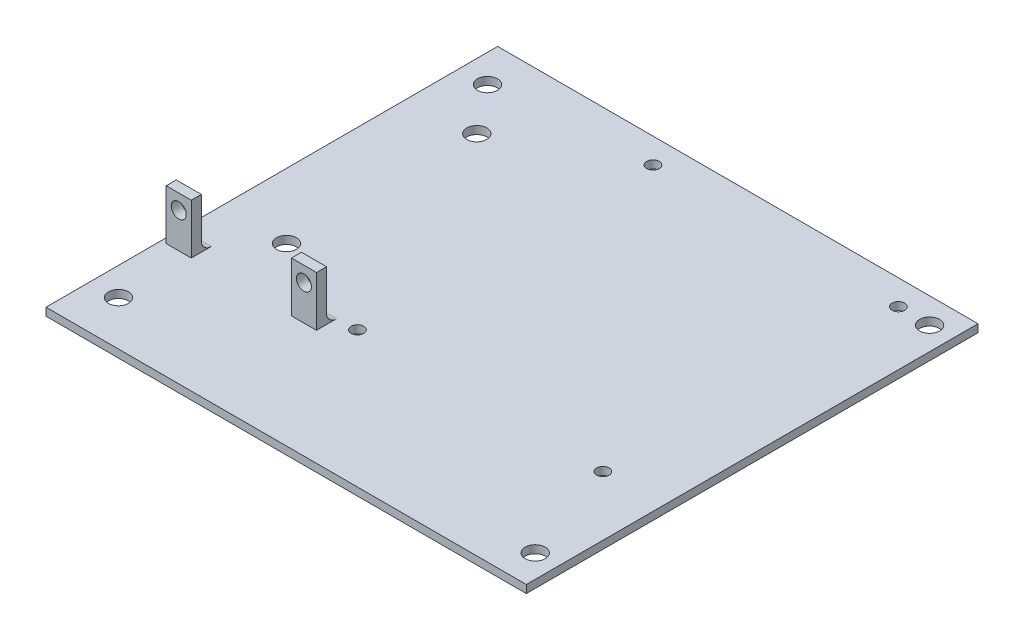
ISO-10303-21;
HEADER;
FILE_DESCRIPTION(('STEP AP214'),'2;1');
FILE_NAME('part.step','',(''),(''),'','','');
FILE_SCHEMA(('AUTOMOTIVE_DESIGN { 1 0 10303 214 1 1 1 1 }'));
ENDSEC;
DATA;
#1=APPLICATION_CONTEXT('core data for automotive mechanical design processes');
#2=APPLICATION_PROTOCOL_DEFINITION('international standard','automotive_design',2000,#1);
#3=PRODUCT_CONTEXT('',#1,'mechanical');
#4=PRODUCT('Part','Part','',(#3));
#5=PRODUCT_RELATED_PRODUCT_CATEGORY('part','',(#4));
#6=PRODUCT_DEFINITION_FORMATION('','',#4);
#7=PRODUCT_DEFINITION_CONTEXT('part definition',#1,'design');
#8=PRODUCT_DEFINITION('design','',#6,#7);
#9=PRODUCT_DEFINITION_SHAPE('','',#8);
#10=(LENGTH_UNIT() NAMED_UNIT(*) SI_UNIT(.MILLI.,.METRE.));
#11=(NAMED_UNIT(*) PLANE_ANGLE_UNIT() SI_UNIT($,.RADIAN.));
#12=(NAMED_UNIT(*) SI_UNIT($,.STERADIAN.) SOLID_ANGLE_UNIT());
#13=UNCERTAINTY_MEASURE_WITH_UNIT(LENGTH_MEASURE(1.E-05),#10,'distance_accuracy_value','');
#14=(GEOMETRIC_REPRESENTATION_CONTEXT(3) GLOBAL_UNCERTAINTY_ASSIGNED_CONTEXT((#13)) GLOBAL_UNIT_ASSIGNED_CONTEXT((#10,
#11,#12)) REPRESENTATION_CONTEXT('',''));
#15=CARTESIAN_POINT('',(0.,0.,0.));
#16=DIRECTION('',(0.,0.,1.));
#17=DIRECTION('',(1.,0.,0.));
#18=AXIS2_PLACEMENT_3D('',#15,#16,#17);
#19=CARTESIAN_POINT('',(0.,1.57,0.));
#20=DIRECTION('',(0.,1.,0.));
#21=DIRECTION('',(0.,0.,1.));
#22=AXIS2_PLACEMENT_3D('',#19,#20,#21);
#23=PLANE('',#22);
#24=DIRECTION('',(0.,0.,1.));
#25=VECTOR('',#24,1.);
#26=CARTESIAN_POINT('',(-30.7440500490529,1.57,-41.5489965335949));
#27=LINE('',#26,#25);
#28=CARTESIAN_POINT('',(-30.7440500490529,1.57,-45.5489965335949));
#29=VERTEX_POINT('',#28);
#30=CARTESIAN_POINT('',(-30.7440500490529,1.57,-41.5489965335949));
#31=VERTEX_POINT('',#30);
#32=EDGE_CURVE('E155',#29,#31,#27,.T.);
#33=ORIENTED_EDGE('',*,*,#32,.F.);
#34=DIRECTION('',(-1.,0.,0.));
#35=VECTOR('',#34,1.);
#36=CARTESIAN_POINT('',(0.,1.57,-45.5489965335949));
#37=LINE('',#36,#35);
#38=CARTESIAN_POINT('',(-25.7440500490529,1.57,-45.5489965335949));
#39=VERTEX_POINT('',#38);
#40=EDGE_CURVE('E284',#29,#39,#37,.F.);
#41=ORIENTED_EDGE('',*,*,#40,.T.);
#42=DIRECTION('',(0.,0.,-1.));
#43=VECTOR('',#42,1.);
#44=CARTESIAN_POINT('',(-25.7440500490529,1.57,-41.5489965335949));
#45=LINE('',#44,#43);
#46=CARTESIAN_POINT('',(-25.7440500490529,1.57,-41.5489965335949));
#47=VERTEX_POINT('',#46);
#48=EDGE_CURVE('E168',#47,#39,#45,.T.);
#49=ORIENTED_EDGE('',*,*,#48,.F.);
#50=DIRECTION('',(1.,0.,0.));
#51=VECTOR('',#50,1.);
#52=CARTESIAN_POINT('',(-30.7440500490529,1.57,-41.5489965335949));
#53=LINE('',#52,#51);
#54=EDGE_CURVE('E158',#31,#47,#53,.T.);
#55=ORIENTED_EDGE('',*,*,#54,.F.);
#56=EDGE_LOOP('',(#33,#41,#49,#55));
#57=FACE_BOUND('',#56,.T.);
#58=CARTESIAN_POINT('',(-18.7440500490529,1.57,-53.5489965335949));
#59=DIRECTION('',(0.,1.,0.));
#60=DIRECTION('',(0.,0.,1.));
#61=AXIS2_PLACEMENT_3D('',#58,#59,#60);
#62=CIRCLE('',#61,2.);
#63=CARTESIAN_POINT('',(-18.7440500490529,1.57,-51.5489965335949));
#64=VERTEX_POINT('',#63);
#65=EDGE_CURVE('E187',#64,#64,#62,.T.);
#66=ORIENTED_EDGE('',*,*,#65,.F.);
#67=EDGE_LOOP('',(#66));
#68=FACE_BOUND('',#67,.T.);
#69=CARTESIAN_POINT('',(-18.7440500490529,1.57,-91.5489965335949));
#70=DIRECTION('',(0.,1.,0.));
#71=DIRECTION('',(0.,0.,1.));
#72=AXIS2_PLACEMENT_3D('',#69,#70,#71);
#73=CIRCLE('',#72,2.);
#74=CARTESIAN_POINT('',(-18.7440500490529,1.57,-89.5489965335949));
#75=VERTEX_POINT('',#74);
#76=EDGE_CURVE('E191',#75,#75,#73,.T.);
#77=ORIENTED_EDGE('',*,*,#76,.F.);
#78=EDGE_LOOP('',(#77));
#79=FACE_BOUND('',#78,.T.);
#80=CARTESIAN_POINT('',(53.2559499509471,1.57,-103.718996533595));
#81=DIRECTION('',(0.,1.,0.));
#82=DIRECTION('',(0.,0.,1.));
#83=AXIS2_PLACEMENT_3D('',#80,#81,#82);
#84=CIRCLE('',#83,1.25);
#85=CARTESIAN_POINT('',(53.2559499509471,1.57,-102.468996533595));
#86=VERTEX_POINT('',#85);
#87=EDGE_CURVE('E195',#86,#86,#84,.T.);
#88=ORIENTED_EDGE('',*,*,#87,.F.);
#89=EDGE_LOOP('',(#88));
#90=FACE_BOUND('',#89,.T.);
#91=CARTESIAN_POINT('',(4.2559499509471,1.57,-103.718996533595));
#92=DIRECTION('',(0.,1.,0.));
#93=DIRECTION('',(0.,0.,1.));
#94=AXIS2_PLACEMENT_3D('',#91,#92,#93);
#95=CIRCLE('',#94,1.25);
#96=CARTESIAN_POINT('',(4.2559499509471,1.57,-102.468996533595));
#97=VERTEX_POINT('',#96);
#98=EDGE_CURVE('E199',#97,#97,#95,.T.);
#99=ORIENTED_EDGE('',*,*,#98,.F.);
#100=EDGE_LOOP('',(#99));
#101=FACE_BOUND('',#100,.T.);
#102=CARTESIAN_POINT('',(52.2559499509471,1.57,-45.718996533595));
#103=DIRECTION('',(0.,1.,0.));
#104=DIRECTION('',(0.,0.,1.));
#105=AXIS2_PLACEMENT_3D('',#102,#103,#104);
#106=CIRCLE('',#105,1.25);
#107=CARTESIAN_POINT('',(52.2559499509471,1.57,-44.468996533595));
#108=VERTEX_POINT('',#107);
#109=EDGE_CURVE('E203',#108,#108,#106,.T.);
#110=ORIENTED_EDGE('',*,*,#109,.F.);
#111=EDGE_LOOP('',(#110));
#112=FACE_BOUND('',#111,.T.);
#113=CARTESIAN_POINT('',(3.25594995094711,1.57,-45.7189965335949));
#114=DIRECTION('',(0.,1.,0.));
#115=DIRECTION('',(0.,0.,1.));
#116=AXIS2_PLACEMENT_3D('',#113,#114,#115);
#117=CIRCLE('',#116,1.25);
#118=CARTESIAN_POINT('',(3.25594995094711,1.57,-44.4689965335949));
#119=VERTEX_POINT('',#118);
#120=EDGE_CURVE('E207',#119,#119,#117,.T.);
#121=ORIENTED_EDGE('',*,*,#120,.F.);
#122=EDGE_LOOP('',(#121));
#123=FACE_BOUND('',#122,.T.);
#124=DIRECTION('',(0.,0.,1.));
#125=VECTOR('',#124,1.);
#126=CARTESIAN_POINT('',(64.1459499509471,1.57,-108.718996533595));
#127=LINE('',#126,#125);
#128=CARTESIAN_POINT('',(64.1459499509471,1.57,-108.718996533595));
#129=VERTEX_POINT('',#128);
#130=CARTESIAN_POINT('',(64.1459499509471,1.57,-18.5489965335949));
#131=VERTEX_POINT('',#130);
#132=EDGE_CURVE('E215',#129,#131,#127,.T.);
#133=ORIENTED_EDGE('',*,*,#132,.F.);
#134=DIRECTION('',(-1.,0.,0.));
#135=VECTOR('',#134,1.);
#136=CARTESIAN_POINT('',(-32.2440500490529,1.57,-108.718996533595));
#137=LINE('',#136,#135);
#138=CARTESIAN_POINT('',(-31.7440500490529,1.57,-108.718996533595));
#139=VERTEX_POINT('',#138);
#140=EDGE_CURVE('E260',#129,#139,#137,.T.);
#141=ORIENTED_EDGE('',*,*,#140,.T.);
#142=DIRECTION('',(0.,0.,-1.));
#143=VECTOR('',#142,1.);
#144=CARTESIAN_POINT('',(-31.7440500490529,1.57,-18.5489965335949));
#145=LINE('',#144,#143);
#146=CARTESIAN_POINT('',(-31.7440500490529,1.57,-18.5489965335949));
#147=VERTEX_POINT('',#146);
#148=EDGE_CURVE('E220',#147,#139,#145,.T.);
#149=ORIENTED_EDGE('',*,*,#148,.F.);
#150=DIRECTION('',(1.,0.,0.));
#151=VECTOR('',#150,1.);
#152=CARTESIAN_POINT('',(-32.2440500490529,1.57,-18.5489965335949));
#153=LINE('',#152,#151);
#154=EDGE_CURVE('E257',#147,#131,#153,.T.);
#155=ORIENTED_EDGE('',*,*,#154,.T.);
#156=EDGE_LOOP('',(#133,#141,#149,#155));
#157=FACE_BOUND('',#156,.T.);
#158=CARTESIAN_POINT('',(59.5659499509471,1.57,-103.638996533595));
#159=DIRECTION('',(0.,1.,0.));
#160=DIRECTION('',(0.,0.,1.));
#161=AXIS2_PLACEMENT_3D('',#158,#159,#160);
#162=CIRCLE('',#161,2.);
#163=CARTESIAN_POINT('',(59.5659499509471,1.57,-101.638996533595));
#164=VERTEX_POINT('',#163);
#165=EDGE_CURVE('E231',#164,#164,#162,.T.);
#166=ORIENTED_EDGE('',*,*,#165,.F.);
#167=EDGE_LOOP('',(#166));
#168=FACE_BOUND('',#167,.T.);
#169=CARTESIAN_POINT('',(-26.1640500490529,1.57,-101.098996533595));
#170=DIRECTION('',(0.,1.,0.));
#171=DIRECTION('',(0.,0.,1.));
#172=AXIS2_PLACEMENT_3D('',#169,#170,#171);
#173=CIRCLE('',#172,2.);
#174=CARTESIAN_POINT('',(-26.1640500490529,1.57,-99.0989965335949));
#175=VERTEX_POINT('',#174);
#176=EDGE_CURVE('E236',#175,#175,#173,.T.);
#177=ORIENTED_EDGE('',*,*,#176,.F.);
#178=EDGE_LOOP('',(#177));
#179=FACE_BOUND('',#178,.T.);
#180=CARTESIAN_POINT('',(-26.1640500490529,1.57,-27.4389965335949));
#181=DIRECTION('',(0.,1.,0.));
#182=DIRECTION('',(0.,0.,1.));
#183=AXIS2_PLACEMENT_3D('',#180,#181,#182);
#184=CIRCLE('',#183,2.);
#185=CARTESIAN_POINT('',(-26.1640500490529,1.57,-25.4389965335949));
#186=VERTEX_POINT('',#185);
#187=EDGE_CURVE('E242',#186,#186,#184,.T.);
#188=ORIENTED_EDGE('',*,*,#187,.F.);
#189=EDGE_LOOP('',(#188));
#190=FACE_BOUND('',#189,.T.);
#191=CARTESIAN_POINT('',(59.5659499509471,1.57,-24.8989965335949));
#192=DIRECTION('',(0.,1.,0.));
#193=DIRECTION('',(0.,0.,1.));
#194=AXIS2_PLACEMENT_3D('',#191,#192,#193);
#195=CIRCLE('',#194,2.);
#196=CARTESIAN_POINT('',(59.5659499509471,1.57,-22.8989965335949));
#197=VERTEX_POINT('',#196);
#198=EDGE_CURVE('E248',#197,#197,#195,.T.);
#199=ORIENTED_EDGE('',*,*,#198,.F.);
#200=EDGE_LOOP('',(#199));
#201=FACE_BOUND('',#200,.T.);
#202=DIRECTION('',(0.,0.,1.));
#203=VECTOR('',#202,1.);
#204=CARTESIAN_POINT('',(-5.74405004905289,1.57,-41.5489965335949));
#205=LINE('',#204,#203);
#206=CARTESIAN_POINT('',(-5.74405004905289,1.57,-45.5489965335949));
#207=VERTEX_POINT('',#206);
#208=CARTESIAN_POINT('',(-5.74405004905289,1.57,-41.5489965335949));
#209=VERTEX_POINT('',#208);
#210=EDGE_CURVE('E297',#207,#209,#205,.T.);
#211=ORIENTED_EDGE('',*,*,#210,.F.);
#212=DIRECTION('',(-1.,0.,0.));
#213=VECTOR('',#212,1.);
#214=CARTESIAN_POINT('',(0.,1.57,-45.5489965335949));
#215=LINE('',#214,#213);
#216=CARTESIAN_POINT('',(-0.744050049052894,1.57,-45.5489965335949));
#217=VERTEX_POINT('',#216);
#218=EDGE_CURVE('E281',#207,#217,#215,.F.);
#219=ORIENTED_EDGE('',*,*,#218,.T.);
#220=DIRECTION('',(0.,0.,-1.));
#221=VECTOR('',#220,1.);
#222=CARTESIAN_POINT('',(-0.744050049052894,1.57,-41.5489965335949));
#223=LINE('',#222,#221);
#224=CARTESIAN_POINT('',(-0.744050049052894,1.57,-41.5489965335949));
#225=VERTEX_POINT('',#224);
#226=EDGE_CURVE('E301',#225,#217,#223,.T.);
#227=ORIENTED_EDGE('',*,*,#226,.F.);
#228=DIRECTION('',(1.,0.,0.));
#229=VECTOR('',#228,1.);
#230=CARTESIAN_POINT('',(-0.744050049052894,1.57,-41.5489965335949));
#231=LINE('',#230,#229);
#232=EDGE_CURVE('E152',#209,#225,#231,.T.);
#233=ORIENTED_EDGE('',*,*,#232,.F.);
#234=EDGE_LOOP('',(#211,#219,#227,#233));
#235=FACE_BOUND('',#234,.T.);
#236=ADVANCED_FACE('F35',(#57,#68,#79,#90,#101,#112,#123,#157,#168,#179,#190,#201,#235),#23,.T.);
#237=CARTESIAN_POINT('',(-32.2440500490529,1.57,-18.5489965335949));
#238=DIRECTION('',(0.,0.,-1.));
#239=DIRECTION('',(-1.,0.,0.));
#240=AXIS2_PLACEMENT_3D('',#237,#238,#239);
#241=PLANE('',#240);
#242=DIRECTION('',(1.,0.,0.));
#243=VECTOR('',#242,1.);
#244=CARTESIAN_POINT('',(-32.2440500490529,0.,-18.5489965335949));
#245=LINE('',#244,#243);
#246=CARTESIAN_POINT('',(-31.7440500490529,0.,-18.5489965335949));
#247=VERTEX_POINT('',#246);
#248=CARTESIAN_POINT('',(64.1459499509471,0.,-18.5489965335949));
#249=VERTEX_POINT('',#248);
#250=EDGE_CURVE('E254',#247,#249,#245,.T.);
#251=ORIENTED_EDGE('',*,*,#250,.T.);
#252=DIRECTION('',(0.,1.,0.));
#253=VECTOR('',#252,1.);
#254=CARTESIAN_POINT('',(64.1459499509471,0.,-18.5489965335949));
#255=LINE('',#254,#253);
#256=EDGE_CURVE('E217',#249,#131,#255,.T.);
#257=ORIENTED_EDGE('',*,*,#256,.T.);
#258=ORIENTED_EDGE('',*,*,#154,.F.);
#259=DIRECTION('',(0.,1.,0.));
#260=VECTOR('',#259,1.);
#261=CARTESIAN_POINT('',(-31.7440500490529,0.,-18.5489965335949));
#262=LINE('',#261,#260);
#263=EDGE_CURVE('E225',#247,#147,#262,.T.);
#264=ORIENTED_EDGE('',*,*,#263,.F.);
#265=EDGE_LOOP('',(#251,#257,#258,#264));
#266=FACE_BOUND('',#265,.T.);
#267=ADVANCED_FACE('F338',(#266),#241,.F.);
#268=CARTESIAN_POINT('',(-32.2440500490529,1.57,-108.718996533595));
#269=DIRECTION('',(0.,0.,1.));
#270=DIRECTION('',(1.,0.,0.));
#271=AXIS2_PLACEMENT_3D('',#268,#269,#270);
#272=PLANE('',#271);
#273=ORIENTED_EDGE('',*,*,#140,.F.);
#274=DIRECTION('',(0.,1.,0.));
#275=VECTOR('',#274,1.);
#276=CARTESIAN_POINT('',(64.1459499509471,0.,-108.718996533595));
#277=LINE('',#276,#275);
#278=CARTESIAN_POINT('',(64.1459499509471,0.,-108.718996533595));
#279=VERTEX_POINT('',#278);
#280=EDGE_CURVE('E214',#279,#129,#277,.T.);
#281=ORIENTED_EDGE('',*,*,#280,.F.);
#282=DIRECTION('',(-1.,0.,0.));
#283=VECTOR('',#282,1.);
#284=CARTESIAN_POINT('',(-32.2440500490529,0.,-108.718996533595));
#285=LINE('',#284,#283);
#286=CARTESIAN_POINT('',(-31.7440500490529,0.,-108.718996533595));
#287=VERTEX_POINT('',#286);
#288=EDGE_CURVE('E261',#279,#287,#285,.T.);
#289=ORIENTED_EDGE('',*,*,#288,.T.);
#290=DIRECTION('',(0.,1.,0.));
#291=VECTOR('',#290,1.);
#292=CARTESIAN_POINT('',(-31.7440500490529,0.,-108.718996533595));
#293=LINE('',#292,#291);
#294=EDGE_CURVE('E228',#287,#139,#293,.T.);
#295=ORIENTED_EDGE('',*,*,#294,.T.);
#296=EDGE_LOOP('',(#273,#281,#289,#295));
#297=FACE_BOUND('',#296,.T.);
#298=ADVANCED_FACE('F344',(#297),#272,.F.);
#299=CARTESIAN_POINT('',(0.,0.,0.));
#300=DIRECTION('',(0.,1.,0.));
#301=DIRECTION('',(0.,0.,1.));
#302=AXIS2_PLACEMENT_3D('',#299,#300,#301);
#303=PLANE('',#302);
#304=CARTESIAN_POINT('',(-18.7440500490529,0.,-53.5489965335949));
#305=DIRECTION('',(0.,1.,0.));
#306=DIRECTION('',(0.,0.,1.));
#307=AXIS2_PLACEMENT_3D('',#304,#305,#306);
#308=CIRCLE('',#307,2.);
#309=CARTESIAN_POINT('',(-18.7440500490529,0.,-51.5489965335949));
#310=VERTEX_POINT('',#309);
#311=EDGE_CURVE('E190',#310,#310,#308,.T.);
#312=ORIENTED_EDGE('',*,*,#311,.T.);
#313=EDGE_LOOP('',(#312));
#314=FACE_BOUND('',#313,.T.);
#315=CARTESIAN_POINT('',(-18.7440500490529,0.,-91.5489965335949));
#316=DIRECTION('',(0.,1.,0.));
#317=DIRECTION('',(0.,0.,1.));
#318=AXIS2_PLACEMENT_3D('',#315,#316,#317);
#319=CIRCLE('',#318,2.);
#320=CARTESIAN_POINT('',(-18.7440500490529,0.,-89.5489965335949));
#321=VERTEX_POINT('',#320);
#322=EDGE_CURVE('E194',#321,#321,#319,.T.);
#323=ORIENTED_EDGE('',*,*,#322,.T.);
#324=EDGE_LOOP('',(#323));
#325=FACE_BOUND('',#324,.T.);
#326=CARTESIAN_POINT('',(53.2559499509471,0.,-103.718996533595));
#327=DIRECTION('',(0.,1.,0.));
#328=DIRECTION('',(0.,0.,1.));
#329=AXIS2_PLACEMENT_3D('',#326,#327,#328);
#330=CIRCLE('',#329,1.25);
#331=CARTESIAN_POINT('',(53.2559499509471,0.,-102.468996533595));
#332=VERTEX_POINT('',#331);
#333=EDGE_CURVE('E198',#332,#332,#330,.T.);
#334=ORIENTED_EDGE('',*,*,#333,.T.);
#335=EDGE_LOOP('',(#334));
#336=FACE_BOUND('',#335,.T.);
#337=CARTESIAN_POINT('',(4.2559499509471,0.,-103.718996533595));
#338=DIRECTION('',(0.,1.,0.));
#339=DIRECTION('',(0.,0.,1.));
#340=AXIS2_PLACEMENT_3D('',#337,#338,#339);
#341=CIRCLE('',#340,1.25);
#342=CARTESIAN_POINT('',(4.2559499509471,0.,-102.468996533595));
#343=VERTEX_POINT('',#342);
#344=EDGE_CURVE('E202',#343,#343,#341,.T.);
#345=ORIENTED_EDGE('',*,*,#344,.T.);
#346=EDGE_LOOP('',(#345));
#347=FACE_BOUND('',#346,.T.);
#348=CARTESIAN_POINT('',(52.2559499509471,0.,-45.718996533595));
#349=DIRECTION('',(0.,1.,0.));
#350=DIRECTION('',(0.,0.,1.));
#351=AXIS2_PLACEMENT_3D('',#348,#349,#350);
#352=CIRCLE('',#351,1.25);
#353=CARTESIAN_POINT('',(52.2559499509471,0.,-44.468996533595));
#354=VERTEX_POINT('',#353);
#355=EDGE_CURVE('E206',#354,#354,#352,.T.);
#356=ORIENTED_EDGE('',*,*,#355,.T.);
#357=EDGE_LOOP('',(#356));
#358=FACE_BOUND('',#357,.T.);
#359=CARTESIAN_POINT('',(3.25594995094711,0.,-45.7189965335949));
#360=DIRECTION('',(0.,1.,0.));
#361=DIRECTION('',(0.,0.,1.));
#362=AXIS2_PLACEMENT_3D('',#359,#360,#361);
#363=CIRCLE('',#362,1.25);
#364=CARTESIAN_POINT('',(3.25594995094711,0.,-44.4689965335949));
#365=VERTEX_POINT('',#364);
#366=EDGE_CURVE('E210',#365,#365,#363,.T.);
#367=ORIENTED_EDGE('',*,*,#366,.T.);
#368=EDGE_LOOP('',(#367));
#369=FACE_BOUND('',#368,.T.);
#370=CARTESIAN_POINT('',(59.5659499509471,0.,-103.638996533595));
#371=DIRECTION('',(0.,1.,0.));
#372=DIRECTION('',(0.,0.,1.));
#373=AXIS2_PLACEMENT_3D('',#370,#371,#372);
#374=CIRCLE('',#373,2.);
#375=CARTESIAN_POINT('',(59.5659499509471,0.,-101.638996533595));
#376=VERTEX_POINT('',#375);
#377=EDGE_CURVE('E233',#376,#376,#374,.T.);
#378=ORIENTED_EDGE('',*,*,#377,.T.);
#379=EDGE_LOOP('',(#378));
#380=FACE_BOUND('',#379,.T.);
#381=CARTESIAN_POINT('',(-26.1640500490529,0.,-101.098996533595));
#382=DIRECTION('',(0.,1.,0.));
#383=DIRECTION('',(0.,0.,1.));
#384=AXIS2_PLACEMENT_3D('',#381,#382,#383);
#385=CIRCLE('',#384,2.);
#386=CARTESIAN_POINT('',(-26.1640500490529,0.,-99.0989965335949));
#387=VERTEX_POINT('',#386);
#388=EDGE_CURVE('E239',#387,#387,#385,.T.);
#389=ORIENTED_EDGE('',*,*,#388,.T.);
#390=EDGE_LOOP('',(#389));
#391=FACE_BOUND('',#390,.T.);
#392=CARTESIAN_POINT('',(-26.1640500490529,0.,-27.4389965335949));
#393=DIRECTION('',(0.,1.,0.));
#394=DIRECTION('',(0.,0.,1.));
#395=AXIS2_PLACEMENT_3D('',#392,#393,#394);
#396=CIRCLE('',#395,2.);
#397=CARTESIAN_POINT('',(-26.1640500490529,0.,-25.4389965335949));
#398=VERTEX_POINT('',#397);
#399=EDGE_CURVE('E245',#398,#398,#396,.T.);
#400=ORIENTED_EDGE('',*,*,#399,.T.);
#401=EDGE_LOOP('',(#400));
#402=FACE_BOUND('',#401,.T.);
#403=CARTESIAN_POINT('',(59.5659499509471,0.,-24.8989965335949));
#404=DIRECTION('',(0.,1.,0.));
#405=DIRECTION('',(0.,0.,1.));
#406=AXIS2_PLACEMENT_3D('',#403,#404,#405);
#407=CIRCLE('',#406,2.);
#408=CARTESIAN_POINT('',(59.5659499509471,0.,-22.8989965335949));
#409=VERTEX_POINT('',#408);
#410=EDGE_CURVE('E251',#409,#409,#407,.T.);
#411=ORIENTED_EDGE('',*,*,#410,.T.);
#412=EDGE_LOOP('',(#411));
#413=FACE_BOUND('',#412,.T.);
#414=ORIENTED_EDGE('',*,*,#288,.F.);
#415=DIRECTION('',(0.,0.,1.));
#416=VECTOR('',#415,1.);
#417=CARTESIAN_POINT('',(64.1459499509471,0.,-108.718996533595));
#418=LINE('',#417,#416);
#419=EDGE_CURVE('E211',#279,#249,#418,.T.);
#420=ORIENTED_EDGE('',*,*,#419,.T.);
#421=ORIENTED_EDGE('',*,*,#250,.F.);
#422=DIRECTION('',(0.,0.,-1.));
#423=VECTOR('',#422,1.);
#424=CARTESIAN_POINT('',(-31.7440500490529,0.,-18.5489965335949));
#425=LINE('',#424,#423);
#426=EDGE_CURVE('E222',#247,#287,#425,.T.);
#427=ORIENTED_EDGE('',*,*,#426,.T.);
#428=EDGE_LOOP('',(#414,#420,#421,#427));
#429=FACE_BOUND('',#428,.T.);
#430=ADVANCED_FACE('F352',(#314,#325,#336,#347,#358,#369,#380,#391,#402,#413,#429),#303,.F.);
#431=CARTESIAN_POINT('',(59.5659499509471,0.,-24.8989965335949));
#432=DIRECTION('',(0.,1.,0.));
#433=DIRECTION('',(0.,0.,1.));
#434=AXIS2_PLACEMENT_3D('',#431,#432,#433);
#435=CYLINDRICAL_SURFACE('',#434,2.);
#436=ORIENTED_EDGE('',*,*,#410,.F.);
#437=EDGE_LOOP('',(#436));
#438=FACE_BOUND('',#437,.T.);
#439=ORIENTED_EDGE('',*,*,#198,.T.);
#440=EDGE_LOOP('',(#439));
#441=FACE_BOUND('',#440,.T.);
#442=ADVANCED_FACE('F350',(#438,#441),#435,.F.);
#443=CARTESIAN_POINT('',(-26.1640500490529,0.,-27.4389965335949));
#444=DIRECTION('',(0.,1.,0.));
#445=DIRECTION('',(0.,0.,1.));
#446=AXIS2_PLACEMENT_3D('',#443,#444,#445);
#447=CYLINDRICAL_SURFACE('',#446,2.);
#448=ORIENTED_EDGE('',*,*,#399,.F.);
#449=EDGE_LOOP('',(#448));
#450=FACE_BOUND('',#449,.T.);
#451=ORIENTED_EDGE('',*,*,#187,.T.);
#452=EDGE_LOOP('',(#451));
#453=FACE_BOUND('',#452,.T.);
#454=ADVANCED_FACE('F436',(#450,#453),#447,.F.);
#455=CARTESIAN_POINT('',(-26.1640500490529,0.,-101.098996533595));
#456=DIRECTION('',(0.,1.,0.));
#457=DIRECTION('',(0.,0.,1.));
#458=AXIS2_PLACEMENT_3D('',#455,#456,#457);
#459=CYLINDRICAL_SURFACE('',#458,2.);
#460=ORIENTED_EDGE('',*,*,#388,.F.);
#461=EDGE_LOOP('',(#460));
#462=FACE_BOUND('',#461,.T.);
#463=ORIENTED_EDGE('',*,*,#176,.T.);
#464=EDGE_LOOP('',(#463));
#465=FACE_BOUND('',#464,.T.);
#466=ADVANCED_FACE('F433',(#462,#465),#459,.F.);
#467=CARTESIAN_POINT('',(59.5659499509471,0.,-103.638996533595));
#468=DIRECTION('',(0.,1.,0.));
#469=DIRECTION('',(0.,0.,1.));
#470=AXIS2_PLACEMENT_3D('',#467,#468,#469);
#471=CYLINDRICAL_SURFACE('',#470,2.);
#472=ORIENTED_EDGE('',*,*,#377,.F.);
#473=EDGE_LOOP('',(#472));
#474=FACE_BOUND('',#473,.T.);
#475=ORIENTED_EDGE('',*,*,#165,.T.);
#476=EDGE_LOOP('',(#475));
#477=FACE_BOUND('',#476,.T.);
#478=ADVANCED_FACE('F429',(#474,#477),#471,.F.);
#479=CARTESIAN_POINT('',(-31.7440500490529,0.,-18.5489965335949));
#480=DIRECTION('',(1.,0.,0.));
#481=DIRECTION('',(0.,0.,-1.));
#482=AXIS2_PLACEMENT_3D('',#479,#480,#481);
#483=PLANE('',#482);
#484=ORIENTED_EDGE('',*,*,#148,.T.);
#485=ORIENTED_EDGE('',*,*,#294,.F.);
#486=ORIENTED_EDGE('',*,*,#426,.F.);
#487=ORIENTED_EDGE('',*,*,#263,.T.);
#488=EDGE_LOOP('',(#484,#485,#486,#487));
#489=FACE_BOUND('',#488,.T.);
#490=ADVANCED_FACE('F425',(#489),#483,.F.);
#491=CARTESIAN_POINT('',(64.1459499509471,0.,-108.718996533595));
#492=DIRECTION('',(-1.,0.,0.));
#493=DIRECTION('',(0.,0.,1.));
#494=AXIS2_PLACEMENT_3D('',#491,#492,#493);
#495=PLANE('',#494);
#496=ORIENTED_EDGE('',*,*,#132,.T.);
#497=ORIENTED_EDGE('',*,*,#256,.F.);
#498=ORIENTED_EDGE('',*,*,#419,.F.);
#499=ORIENTED_EDGE('',*,*,#280,.T.);
#500=EDGE_LOOP('',(#496,#497,#498,#499));
#501=FACE_BOUND('',#500,.T.);
#502=ADVANCED_FACE('F421',(#501),#495,.F.);
#503=CARTESIAN_POINT('',(3.25594995094711,-8.43,-45.7189965335949));
#504=DIRECTION('',(0.,1.,0.));
#505=DIRECTION('',(0.,0.,1.));
#506=AXIS2_PLACEMENT_3D('',#503,#504,#505);
#507=CYLINDRICAL_SURFACE('',#506,1.25);
#508=ORIENTED_EDGE('',*,*,#120,.T.);
#509=EDGE_LOOP('',(#508));
#510=FACE_BOUND('',#509,.T.);
#511=ORIENTED_EDGE('',*,*,#366,.F.);
#512=EDGE_LOOP('',(#511));
#513=FACE_BOUND('',#512,.T.);
#514=ADVANCED_FACE('F417',(#510,#513),#507,.F.);
#515=CARTESIAN_POINT('',(52.2559499509471,-8.43,-45.718996533595));
#516=DIRECTION('',(0.,1.,0.));
#517=DIRECTION('',(0.,0.,1.));
#518=AXIS2_PLACEMENT_3D('',#515,#516,#517);
#519=CYLINDRICAL_SURFACE('',#518,1.25);
#520=ORIENTED_EDGE('',*,*,#109,.T.);
#521=EDGE_LOOP('',(#520));
#522=FACE_BOUND('',#521,.T.);
#523=ORIENTED_EDGE('',*,*,#355,.F.);
#524=EDGE_LOOP('',(#523));
#525=FACE_BOUND('',#524,.T.);
#526=ADVANCED_FACE('F413',(#522,#525),#519,.F.);
#527=CARTESIAN_POINT('',(4.2559499509471,-8.43,-103.718996533595));
#528=DIRECTION('',(0.,1.,0.));
#529=DIRECTION('',(0.,0.,1.));
#530=AXIS2_PLACEMENT_3D('',#527,#528,#529);
#531=CYLINDRICAL_SURFACE('',#530,1.25);
#532=ORIENTED_EDGE('',*,*,#98,.T.);
#533=EDGE_LOOP('',(#532));
#534=FACE_BOUND('',#533,.T.);
#535=ORIENTED_EDGE('',*,*,#344,.F.);
#536=EDGE_LOOP('',(#535));
#537=FACE_BOUND('',#536,.T.);
#538=ADVANCED_FACE('F409',(#534,#537),#531,.F.);
#539=CARTESIAN_POINT('',(53.2559499509471,-8.43,-103.718996533595));
#540=DIRECTION('',(0.,1.,0.));
#541=DIRECTION('',(0.,0.,1.));
#542=AXIS2_PLACEMENT_3D('',#539,#540,#541);
#543=CYLINDRICAL_SURFACE('',#542,1.25);
#544=ORIENTED_EDGE('',*,*,#87,.T.);
#545=EDGE_LOOP('',(#544));
#546=FACE_BOUND('',#545,.T.);
#547=ORIENTED_EDGE('',*,*,#333,.F.);
#548=EDGE_LOOP('',(#547));
#549=FACE_BOUND('',#548,.T.);
#550=ADVANCED_FACE('F405',(#546,#549),#543,.F.);
#551=CARTESIAN_POINT('',(-18.7440500490529,-8.43,-91.5489965335949));
#552=DIRECTION('',(0.,1.,0.));
#553=DIRECTION('',(0.,0.,1.));
#554=AXIS2_PLACEMENT_3D('',#551,#552,#553);
#555=CYLINDRICAL_SURFACE('',#554,2.);
#556=ORIENTED_EDGE('',*,*,#76,.T.);
#557=EDGE_LOOP('',(#556));
#558=FACE_BOUND('',#557,.T.);
#559=ORIENTED_EDGE('',*,*,#322,.F.);
#560=EDGE_LOOP('',(#559));
#561=FACE_BOUND('',#560,.T.);
#562=ADVANCED_FACE('F401',(#558,#561),#555,.F.);
#563=CARTESIAN_POINT('',(-18.7440500490529,-8.43,-53.5489965335949));
#564=DIRECTION('',(0.,1.,0.));
#565=DIRECTION('',(0.,0.,1.));
#566=AXIS2_PLACEMENT_3D('',#563,#564,#565);
#567=CYLINDRICAL_SURFACE('',#566,2.);
#568=ORIENTED_EDGE('',*,*,#65,.T.);
#569=EDGE_LOOP('',(#568));
#570=FACE_BOUND('',#569,.T.);
#571=ORIENTED_EDGE('',*,*,#311,.F.);
#572=EDGE_LOOP('',(#571));
#573=FACE_BOUND('',#572,.T.);
#574=ADVANCED_FACE('F394',(#570,#573),#567,.F.);
#575=CARTESIAN_POINT('',(-30.7440500490529,11.57,-41.5489965335949));
#576=DIRECTION('',(1.,0.,0.));
#577=DIRECTION('',(0.,0.,-1.));
#578=AXIS2_PLACEMENT_3D('',#575,#576,#577);
#579=PLANE('',#578);
#580=ORIENTED_EDGE('',*,*,#32,.T.);
#581=DIRECTION('',(0.,-1.,0.));
#582=VECTOR('',#581,1.);
#583=CARTESIAN_POINT('',(-30.7440500490529,11.57,-41.5489965335949));
#584=LINE('',#583,#582);
#585=CARTESIAN_POINT('',(-30.7440500490529,11.57,-41.5489965335949));
#586=VERTEX_POINT('',#585);
#587=EDGE_CURVE('E185',#586,#31,#584,.T.);
#588=ORIENTED_EDGE('',*,*,#587,.F.);
#589=DIRECTION('',(0.,0.,1.));
#590=VECTOR('',#589,1.);
#591=CARTESIAN_POINT('',(-30.7440500490529,11.57,-41.5489965335949));
#592=LINE('',#591,#590);
#593=CARTESIAN_POINT('',(-30.7440500490529,11.57,-43.5489965335949));
#594=VERTEX_POINT('',#593);
#595=EDGE_CURVE('E164',#594,#586,#592,.T.);
#596=ORIENTED_EDGE('',*,*,#595,.F.);
#597=DIRECTION('',(0.,-1.,0.));
#598=VECTOR('',#597,1.);
#599=CARTESIAN_POINT('',(-30.7440500490529,11.57,-43.5489965335949));
#600=LINE('',#599,#598);
#601=CARTESIAN_POINT('',(-30.7440500490529,3.57,-43.5489965335949));
#602=VERTEX_POINT('',#601);
#603=EDGE_CURVE('E173',#594,#602,#600,.T.);
#604=ORIENTED_EDGE('',*,*,#603,.T.);
#605=CARTESIAN_POINT('',(-30.7440500490529,3.57,-45.5489965335949));
#606=DIRECTION('',(1.,0.,0.));
#607=DIRECTION('',(0.,0.,-1.));
#608=AXIS2_PLACEMENT_3D('',#605,#606,#607);
#609=CIRCLE('',#608,2.);
#610=EDGE_CURVE('E289',#602,#29,#609,.T.);
#611=ORIENTED_EDGE('',*,*,#610,.T.);
#612=EDGE_LOOP('',(#580,#588,#596,#604,#611));
#613=FACE_BOUND('',#612,.T.);
#614=ADVANCED_FACE('F384',(#613),#579,.F.);
#615=CARTESIAN_POINT('',(-30.7440500490529,11.57,-41.5489965335949));
#616=DIRECTION('',(0.,0.,-1.));
#617=DIRECTION('',(-1.,0.,0.));
#618=AXIS2_PLACEMENT_3D('',#615,#616,#617);
#619=PLANE('',#618);
#620=CARTESIAN_POINT('',(-28.2440500490529,8.57,-41.5489965335949));
#621=DIRECTION('',(0.,0.,1.));
#622=DIRECTION('',(1.,0.,0.));
#623=AXIS2_PLACEMENT_3D('',#620,#621,#622);
#624=CIRCLE('',#623,1.5);
#625=CARTESIAN_POINT('',(-26.7440500490529,8.57,-41.5489965335949));
#626=VERTEX_POINT('',#625);
#627=EDGE_CURVE('E315',#626,#626,#624,.T.);
#628=ORIENTED_EDGE('',*,*,#627,.F.);
#629=EDGE_LOOP('',(#628));
#630=FACE_BOUND('',#629,.T.);
#631=ORIENTED_EDGE('',*,*,#54,.T.);
#632=DIRECTION('',(0.,-1.,0.));
#633=VECTOR('',#632,1.);
#634=CARTESIAN_POINT('',(-25.7440500490529,11.57,-41.5489965335949));
#635=LINE('',#634,#633);
#636=CARTESIAN_POINT('',(-25.7440500490529,11.57,-41.5489965335949));
#637=VERTEX_POINT('',#636);
#638=EDGE_CURVE('E182',#637,#47,#635,.T.);
#639=ORIENTED_EDGE('',*,*,#638,.F.);
#640=DIRECTION('',(1.,0.,0.));
#641=VECTOR('',#640,1.);
#642=CARTESIAN_POINT('',(-30.7440500490529,11.57,-41.5489965335949));
#643=LINE('',#642,#641);
#644=EDGE_CURVE('E167',#586,#637,#643,.T.);
#645=ORIENTED_EDGE('',*,*,#644,.F.);
#646=ORIENTED_EDGE('',*,*,#587,.T.);
#647=EDGE_LOOP('',(#631,#639,#645,#646));
#648=FACE_BOUND('',#647,.T.);
#649=ADVANCED_FACE('F385',(#630,#648),#619,.F.);
#650=CARTESIAN_POINT('',(-25.7440500490529,11.57,-41.5489965335949));
#651=DIRECTION('',(-1.,0.,0.));
#652=DIRECTION('',(0.,0.,1.));
#653=AXIS2_PLACEMENT_3D('',#650,#651,#652);
#654=PLANE('',#653);
#655=ORIENTED_EDGE('',*,*,#48,.T.);
#656=CARTESIAN_POINT('',(-25.7440500490529,3.57,-45.5489965335949));
#657=DIRECTION('',(-1.,0.,0.));
#658=DIRECTION('',(0.,0.,1.));
#659=AXIS2_PLACEMENT_3D('',#656,#657,#658);
#660=CIRCLE('',#659,2.);
#661=CARTESIAN_POINT('',(-25.7440500490529,3.57,-43.5489965335949));
#662=VERTEX_POINT('',#661);
#663=EDGE_CURVE('E292',#39,#662,#660,.T.);
#664=ORIENTED_EDGE('',*,*,#663,.T.);
#665=DIRECTION('',(0.,-1.,0.));
#666=VECTOR('',#665,1.);
#667=CARTESIAN_POINT('',(-25.7440500490529,11.57,-43.5489965335949));
#668=LINE('',#667,#666);
#669=CARTESIAN_POINT('',(-25.7440500490529,11.57,-43.5489965335949));
#670=VERTEX_POINT('',#669);
#671=EDGE_CURVE('E179',#670,#662,#668,.T.);
#672=ORIENTED_EDGE('',*,*,#671,.F.);
#673=DIRECTION('',(0.,0.,-1.));
#674=VECTOR('',#673,1.);
#675=CARTESIAN_POINT('',(-25.7440500490529,11.57,-41.5489965335949));
#676=LINE('',#675,#674);
#677=EDGE_CURVE('E170',#637,#670,#676,.T.);
#678=ORIENTED_EDGE('',*,*,#677,.F.);
#679=ORIENTED_EDGE('',*,*,#638,.T.);
#680=EDGE_LOOP('',(#655,#664,#672,#678,#679));
#681=FACE_BOUND('',#680,.T.);
#682=ADVANCED_FACE('F369',(#681),#654,.F.);
#683=CARTESIAN_POINT('',(-30.7440500490529,11.57,-43.5489965335949));
#684=DIRECTION('',(0.,0.,1.));
#685=DIRECTION('',(1.,0.,0.));
#686=AXIS2_PLACEMENT_3D('',#683,#684,#685);
#687=PLANE('',#686);
#688=CARTESIAN_POINT('',(-28.2440500490529,8.57,-43.548996533595));
#689=DIRECTION('',(0.,0.,1.));
#690=DIRECTION('',(1.,0.,0.));
#691=AXIS2_PLACEMENT_3D('',#688,#689,#690);
#692=CIRCLE('',#691,1.5);
#693=CARTESIAN_POINT('',(-26.7440500490529,8.57,-43.548996533595));
#694=VERTEX_POINT('',#693);
#695=EDGE_CURVE('E304',#694,#694,#692,.F.);
#696=ORIENTED_EDGE('',*,*,#695,.F.);
#697=EDGE_LOOP('',(#696));
#698=FACE_BOUND('',#697,.T.);
#699=ORIENTED_EDGE('',*,*,#671,.T.);
#700=DIRECTION('',(-1.,0.,0.));
#701=VECTOR('',#700,1.);
#702=CARTESIAN_POINT('',(-30.7440500490529,3.57,-43.5489965335949));
#703=LINE('',#702,#701);
#704=EDGE_CURVE('E263',#662,#602,#703,.T.);
#705=ORIENTED_EDGE('',*,*,#704,.T.);
#706=ORIENTED_EDGE('',*,*,#603,.F.);
#707=DIRECTION('',(-1.,0.,0.));
#708=VECTOR('',#707,1.);
#709=CARTESIAN_POINT('',(-30.7440500490529,11.57,-43.5489965335949));
#710=LINE('',#709,#708);
#711=EDGE_CURVE('E172',#670,#594,#710,.T.);
#712=ORIENTED_EDGE('',*,*,#711,.F.);
#713=EDGE_LOOP('',(#699,#705,#706,#712));
#714=FACE_BOUND('',#713,.T.);
#715=ADVANCED_FACE('F374',(#698,#714),#687,.F.);
#716=CARTESIAN_POINT('',(0.,11.57,0.));
#717=DIRECTION('',(0.,-1.,0.));
#718=DIRECTION('',(0.,0.,-1.));
#719=AXIS2_PLACEMENT_3D('',#716,#717,#718);
#720=PLANE('',#719);
#721=ORIENTED_EDGE('',*,*,#595,.T.);
#722=ORIENTED_EDGE('',*,*,#644,.T.);
#723=ORIENTED_EDGE('',*,*,#677,.T.);
#724=ORIENTED_EDGE('',*,*,#711,.T.);
#725=EDGE_LOOP('',(#721,#722,#723,#724));
#726=FACE_BOUND('',#725,.T.);
#727=ADVANCED_FACE('F378',(#726),#720,.F.);
#728=CARTESIAN_POINT('',(-0.744050049052894,11.57,-41.5489965335949));
#729=DIRECTION('',(-1.,0.,0.));
#730=DIRECTION('',(0.,0.,1.));
#731=AXIS2_PLACEMENT_3D('',#728,#729,#730);
#732=PLANE('',#731);
#733=ORIENTED_EDGE('',*,*,#226,.T.);
#734=CARTESIAN_POINT('',(-0.744050049052894,3.57,-45.5489965335949));
#735=DIRECTION('',(-1.,0.,0.));
#736=DIRECTION('',(0.,0.,1.));
#737=AXIS2_PLACEMENT_3D('',#734,#735,#736);
#738=CIRCLE('',#737,2.);
#739=CARTESIAN_POINT('',(-0.744050049052894,3.57,-43.5489965335949));
#740=VERTEX_POINT('',#739);
#741=EDGE_CURVE('E11',#217,#740,#738,.T.);
#742=ORIENTED_EDGE('',*,*,#741,.T.);
#743=DIRECTION('',(0.,-1.,0.));
#744=VECTOR('',#743,1.);
#745=CARTESIAN_POINT('',(-0.744050049052894,11.57,-43.5489965335949));
#746=LINE('',#745,#744);
#747=CARTESIAN_POINT('',(-0.744050049052894,11.57,-43.5489965335949));
#748=VERTEX_POINT('',#747);
#749=EDGE_CURVE('E138',#748,#740,#746,.T.);
#750=ORIENTED_EDGE('',*,*,#749,.F.);
#751=DIRECTION('',(0.,0.,-1.));
#752=VECTOR('',#751,1.);
#753=CARTESIAN_POINT('',(-0.744050049052894,11.57,-41.5489965335949));
#754=LINE('',#753,#752);
#755=CARTESIAN_POINT('',(-0.744050049052894,11.57,-41.5489965335949));
#756=VERTEX_POINT('',#755);
#757=EDGE_CURVE('E144',#756,#748,#754,.T.);
#758=ORIENTED_EDGE('',*,*,#757,.F.);
#759=DIRECTION('',(0.,-1.,0.));
#760=VECTOR('',#759,1.);
#761=CARTESIAN_POINT('',(-0.744050049052894,11.57,-41.5489965335949));
#762=LINE('',#761,#760);
#763=EDGE_CURVE('E308',#756,#225,#762,.T.);
#764=ORIENTED_EDGE('',*,*,#763,.T.);
#765=EDGE_LOOP('',(#733,#742,#750,#758,#764));
#766=FACE_BOUND('',#765,.T.);
#767=ADVANCED_FACE('F154',(#766),#732,.F.);
#768=CARTESIAN_POINT('',(-0.744050049052894,11.57,-43.5489965335949));
#769=DIRECTION('',(0.,0.,1.));
#770=DIRECTION('',(1.,0.,0.));
#771=AXIS2_PLACEMENT_3D('',#768,#769,#770);
#772=PLANE('',#771);
#773=CARTESIAN_POINT('',(-3.2540500490529,8.57,-43.548996533595));
#774=DIRECTION('',(0.,0.,1.));
#775=DIRECTION('',(1.,0.,0.));
#776=AXIS2_PLACEMENT_3D('',#773,#774,#775);
#777=CIRCLE('',#776,1.5);
#778=CARTESIAN_POINT('',(-1.7540500490529,8.57,-43.548996533595));
#779=VERTEX_POINT('',#778);
#780=EDGE_CURVE('E318',#779,#779,#777,.F.);
#781=ORIENTED_EDGE('',*,*,#780,.F.);
#782=EDGE_LOOP('',(#781));
#783=FACE_BOUND('',#782,.T.);
#784=ORIENTED_EDGE('',*,*,#749,.T.);
#785=DIRECTION('',(-1.,0.,0.));
#786=VECTOR('',#785,1.);
#787=CARTESIAN_POINT('',(-0.744050049052894,3.57,-43.5489965335949));
#788=LINE('',#787,#786);
#789=CARTESIAN_POINT('',(-5.74405004905289,3.57,-43.5489965335949));
#790=VERTEX_POINT('',#789);
#791=EDGE_CURVE('E287',#740,#790,#788,.T.);
#792=ORIENTED_EDGE('',*,*,#791,.T.);
#793=DIRECTION('',(0.,-1.,0.));
#794=VECTOR('',#793,1.);
#795=CARTESIAN_POINT('',(-5.74405004905289,11.57,-43.5489965335949));
#796=LINE('',#795,#794);
#797=CARTESIAN_POINT('',(-5.74405004905289,11.57,-43.5489965335949));
#798=VERTEX_POINT('',#797);
#799=EDGE_CURVE('E140',#798,#790,#796,.T.);
#800=ORIENTED_EDGE('',*,*,#799,.F.);
#801=DIRECTION('',(-1.,0.,0.));
#802=VECTOR('',#801,1.);
#803=CARTESIAN_POINT('',(-0.744050049052894,11.57,-43.5489965335949));
#804=LINE('',#803,#802);
#805=EDGE_CURVE('E135',#748,#798,#804,.T.);
#806=ORIENTED_EDGE('',*,*,#805,.F.);
#807=EDGE_LOOP('',(#784,#792,#800,#806));
#808=FACE_BOUND('',#807,.T.);
#809=ADVANCED_FACE('F137',(#783,#808),#772,.F.);
#810=CARTESIAN_POINT('',(-5.74405004905289,11.57,-41.5489965335949));
#811=DIRECTION('',(1.,0.,0.));
#812=DIRECTION('',(0.,0.,-1.));
#813=AXIS2_PLACEMENT_3D('',#810,#811,#812);
#814=PLANE('',#813);
#815=ORIENTED_EDGE('',*,*,#210,.T.);
#816=DIRECTION('',(0.,-1.,0.));
#817=VECTOR('',#816,1.);
#818=CARTESIAN_POINT('',(-5.74405004905289,11.57,-41.5489965335949));
#819=LINE('',#818,#817);
#820=CARTESIAN_POINT('',(-5.74405004905289,11.57,-41.5489965335949));
#821=VERTEX_POINT('',#820);
#822=EDGE_CURVE('E160',#821,#209,#819,.T.);
#823=ORIENTED_EDGE('',*,*,#822,.F.);
#824=DIRECTION('',(0.,0.,1.));
#825=VECTOR('',#824,1.);
#826=CARTESIAN_POINT('',(-5.74405004905289,11.57,-41.5489965335949));
#827=LINE('',#826,#825);
#828=EDGE_CURVE('E143',#798,#821,#827,.T.);
#829=ORIENTED_EDGE('',*,*,#828,.F.);
#830=ORIENTED_EDGE('',*,*,#799,.T.);
#831=CARTESIAN_POINT('',(-5.74405004905289,3.57,-45.5489965335949));
#832=DIRECTION('',(1.,0.,0.));
#833=DIRECTION('',(0.,0.,-1.));
#834=AXIS2_PLACEMENT_3D('',#831,#832,#833);
#835=CIRCLE('',#834,2.);
#836=EDGE_CURVE('E43',#790,#207,#835,.T.);
#837=ORIENTED_EDGE('',*,*,#836,.T.);
#838=EDGE_LOOP('',(#815,#823,#829,#830,#837));
#839=FACE_BOUND('',#838,.T.);
#840=ADVANCED_FACE('F295',(#839),#814,.F.);
#841=CARTESIAN_POINT('',(-0.744050049052894,11.57,-41.5489965335949));
#842=DIRECTION('',(0.,0.,-1.));
#843=DIRECTION('',(-1.,0.,0.));
#844=AXIS2_PLACEMENT_3D('',#841,#842,#843);
#845=PLANE('',#844);
#846=CARTESIAN_POINT('',(-3.2540500490529,8.57,-41.5489965335949));
#847=DIRECTION('',(0.,0.,1.));
#848=DIRECTION('',(1.,0.,0.));
#849=AXIS2_PLACEMENT_3D('',#846,#847,#848);
#850=CIRCLE('',#849,1.5);
#851=CARTESIAN_POINT('',(-1.7540500490529,8.57,-41.5489965335949));
#852=VERTEX_POINT('',#851);
#853=EDGE_CURVE('E321',#852,#852,#850,.T.);
#854=ORIENTED_EDGE('',*,*,#853,.F.);
#855=EDGE_LOOP('',(#854));
#856=FACE_BOUND('',#855,.T.);
#857=ORIENTED_EDGE('',*,*,#232,.T.);
#858=ORIENTED_EDGE('',*,*,#763,.F.);
#859=DIRECTION('',(1.,0.,0.));
#860=VECTOR('',#859,1.);
#861=CARTESIAN_POINT('',(-0.744050049052894,11.57,-41.5489965335949));
#862=LINE('',#861,#860);
#863=EDGE_CURVE('E149',#821,#756,#862,.T.);
#864=ORIENTED_EDGE('',*,*,#863,.F.);
#865=ORIENTED_EDGE('',*,*,#822,.T.);
#866=EDGE_LOOP('',(#857,#858,#864,#865));
#867=FACE_BOUND('',#866,.T.);
#868=ADVANCED_FACE('F310',(#856,#867),#845,.F.);
#869=CARTESIAN_POINT('',(0.,11.57,0.));
#870=DIRECTION('',(0.,1.,0.));
#871=DIRECTION('',(0.,0.,1.));
#872=AXIS2_PLACEMENT_3D('',#869,#870,#871);
#873=PLANE('',#872);
#874=ORIENTED_EDGE('',*,*,#757,.T.);
#875=ORIENTED_EDGE('',*,*,#805,.T.);
#876=ORIENTED_EDGE('',*,*,#828,.T.);
#877=ORIENTED_EDGE('',*,*,#863,.T.);
#878=EDGE_LOOP('',(#874,#875,#876,#877));
#879=FACE_BOUND('',#878,.T.);
#880=ADVANCED_FACE('F147',(#879),#873,.T.);
#881=CARTESIAN_POINT('',(-30.7440500490529,3.57,-45.5489965335949));
#882=DIRECTION('',(-1.,0.,0.));
#883=DIRECTION('',(0.,0.,1.));
#884=AXIS2_PLACEMENT_3D('',#881,#882,#883);
#885=CYLINDRICAL_SURFACE('',#884,2.);
#886=ORIENTED_EDGE('',*,*,#663,.F.);
#887=ORIENTED_EDGE('',*,*,#40,.F.);
#888=ORIENTED_EDGE('',*,*,#610,.F.);
#889=ORIENTED_EDGE('',*,*,#704,.F.);
#890=EDGE_LOOP('',(#886,#887,#888,#889));
#891=FACE_BOUND('',#890,.T.);
#892=ADVANCED_FACE('F334',(#891),#885,.F.);
#893=CARTESIAN_POINT('',(-0.744050049052894,3.57,-45.5489965335949));
#894=DIRECTION('',(-1.,0.,0.));
#895=DIRECTION('',(0.,0.,1.));
#896=AXIS2_PLACEMENT_3D('',#893,#894,#895);
#897=CYLINDRICAL_SURFACE('',#896,2.);
#898=ORIENTED_EDGE('',*,*,#741,.F.);
#899=ORIENTED_EDGE('',*,*,#218,.F.);
#900=ORIENTED_EDGE('',*,*,#836,.F.);
#901=ORIENTED_EDGE('',*,*,#791,.F.);
#902=EDGE_LOOP('',(#898,#899,#900,#901));
#903=FACE_BOUND('',#902,.T.);
#904=ADVANCED_FACE('F37',(#903),#897,.F.);
#905=CARTESIAN_POINT('',(-28.2440500490529,8.57,-108.719996533595));
#906=DIRECTION('',(0.,0.,1.));
#907=DIRECTION('',(1.,0.,0.));
#908=AXIS2_PLACEMENT_3D('',#905,#906,#907);
#909=CYLINDRICAL_SURFACE('',#908,1.5);
#910=ORIENTED_EDGE('',*,*,#627,.T.);
#911=EDGE_LOOP('',(#910));
#912=FACE_BOUND('',#911,.T.);
#913=ORIENTED_EDGE('',*,*,#695,.T.);
#914=EDGE_LOOP('',(#913));
#915=FACE_BOUND('',#914,.T.);
#916=ADVANCED_FACE('F363',(#912,#915),#909,.F.);
#917=CARTESIAN_POINT('',(-3.2540500490529,8.57,-108.719996533595));
#918=DIRECTION('',(0.,0.,1.));
#919=DIRECTION('',(1.,0.,0.));
#920=AXIS2_PLACEMENT_3D('',#917,#918,#919);
#921=CYLINDRICAL_SURFACE('',#920,1.5);
#922=ORIENTED_EDGE('',*,*,#853,.T.);
#923=EDGE_LOOP('',(#922));
#924=FACE_BOUND('',#923,.T.);
#925=ORIENTED_EDGE('',*,*,#780,.T.);
#926=EDGE_LOOP('',(#925));
#927=FACE_BOUND('',#926,.T.);
#928=ADVANCED_FACE('F325',(#924,#927),#921,.F.);
#929=CLOSED_SHELL('',(#236,#267,#298,#430,#442,#454,#466,#478,#490,#502,#514,#526,#538,#550,
#562,#574,#614,#649,#682,#715,#727,#767,#809,#840,#868,#880,#892,#904,#916,#928));
#930=MANIFOLD_SOLID_BREP('B2',#929);
#931=ADVANCED_BREP_SHAPE_REPRESENTATION('',(#18,#930),#14);
#932=SHAPE_DEFINITION_REPRESENTATION(#9,#931);
ENDSEC;
END-ISO-10303-21;
